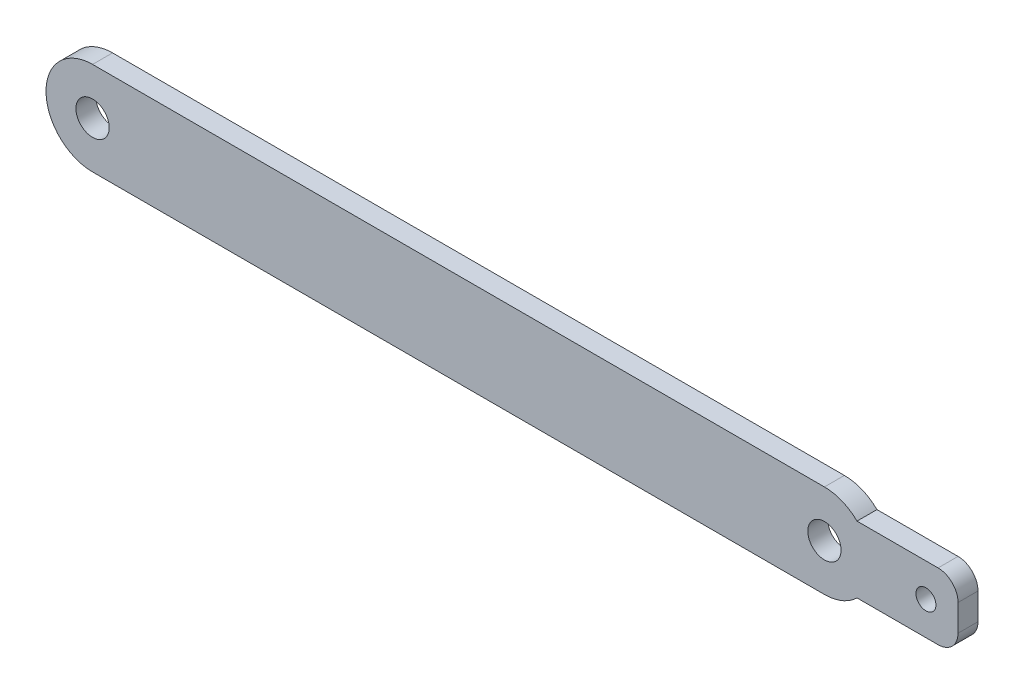
ISO-10303-21;
HEADER;
FILE_DESCRIPTION(('STEP AP214'),'2;1');
FILE_NAME('part.step','',(''),(''),'','','');
FILE_SCHEMA(('AUTOMOTIVE_DESIGN { 1 0 10303 214 1 1 1 1 }'));
ENDSEC;
DATA;
#1=APPLICATION_CONTEXT('core data for automotive mechanical design processes');
#2=APPLICATION_PROTOCOL_DEFINITION('international standard','automotive_design',2000,#1);
#3=PRODUCT_CONTEXT('',#1,'mechanical');
#4=PRODUCT('Part','Part','',(#3));
#5=PRODUCT_RELATED_PRODUCT_CATEGORY('part','',(#4));
#6=PRODUCT_DEFINITION_FORMATION('','',#4);
#7=PRODUCT_DEFINITION_CONTEXT('part definition',#1,'design');
#8=PRODUCT_DEFINITION('design','',#6,#7);
#9=PRODUCT_DEFINITION_SHAPE('','',#8);
#10=(LENGTH_UNIT() NAMED_UNIT(*) SI_UNIT(.MILLI.,.METRE.));
#11=(NAMED_UNIT(*) PLANE_ANGLE_UNIT() SI_UNIT($,.RADIAN.));
#12=(NAMED_UNIT(*) SI_UNIT($,.STERADIAN.) SOLID_ANGLE_UNIT());
#13=UNCERTAINTY_MEASURE_WITH_UNIT(LENGTH_MEASURE(1.E-05),#10,'distance_accuracy_value','');
#14=(GEOMETRIC_REPRESENTATION_CONTEXT(3) GLOBAL_UNCERTAINTY_ASSIGNED_CONTEXT((#13)) GLOBAL_UNIT_ASSIGNED_CONTEXT((#10,
#11,#12)) REPRESENTATION_CONTEXT('',''));
#15=CARTESIAN_POINT('',(0.,0.,0.));
#16=DIRECTION('',(0.,0.,1.));
#17=DIRECTION('',(1.,0.,0.));
#18=AXIS2_PLACEMENT_3D('',#15,#16,#17);
#19=CARTESIAN_POINT('',(39.0409907008859,262.154117688394,3.));
#20=DIRECTION('',(0.,0.,-1.));
#21=DIRECTION('',(-1.,0.,0.));
#22=AXIS2_PLACEMENT_3D('',#19,#20,#21);
#23=CYLINDRICAL_SURFACE('',#22,7.00000000000001);
#24=CARTESIAN_POINT('',(39.0409907008859,262.154117688394,0.));
#25=DIRECTION('',(0.,0.,1.));
#26=DIRECTION('',(1.,0.,0.));
#27=AXIS2_PLACEMENT_3D('',#24,#25,#26);
#28=CIRCLE('',#27,7.00000000000001);
#29=CARTESIAN_POINT('',(39.0409907008859,255.154117688394,0.));
#30=VERTEX_POINT('',#29);
#31=CARTESIAN_POINT('',(43.9399701864523,257.154117688394,0.));
#32=VERTEX_POINT('',#31);
#33=EDGE_CURVE('E184',#30,#32,#28,.T.);
#34=ORIENTED_EDGE('',*,*,#33,.T.);
#35=DIRECTION('',(0.,0.,-1.));
#36=VECTOR('',#35,1.);
#37=CARTESIAN_POINT('',(43.9399701864523,257.154117688394,3.));
#38=LINE('',#37,#36);
#39=CARTESIAN_POINT('',(43.9399701864523,257.154117688394,3.));
#40=VERTEX_POINT('',#39);
#41=EDGE_CURVE('E11',#32,#40,#38,.F.);
#42=ORIENTED_EDGE('',*,*,#41,.T.);
#43=CARTESIAN_POINT('',(39.0409907008859,262.154117688394,3.));
#44=DIRECTION('',(0.,0.,1.));
#45=DIRECTION('',(1.,0.,0.));
#46=AXIS2_PLACEMENT_3D('',#43,#44,#45);
#47=CIRCLE('',#46,7.00000000000001);
#48=CARTESIAN_POINT('',(39.0409907008859,255.154117688394,3.));
#49=VERTEX_POINT('',#48);
#50=EDGE_CURVE('E119',#49,#40,#47,.T.);
#51=ORIENTED_EDGE('',*,*,#50,.F.);
#52=DIRECTION('',(0.,0.,-1.));
#53=VECTOR('',#52,1.);
#54=CARTESIAN_POINT('',(39.0409907008859,255.154117688394,3.));
#55=LINE('',#54,#53);
#56=EDGE_CURVE('E192',#49,#30,#55,.T.);
#57=ORIENTED_EDGE('',*,*,#56,.T.);
#58=EDGE_LOOP('',(#34,#42,#51,#57));
#59=FACE_BOUND('',#58,.T.);
#60=ADVANCED_FACE('F35',(#59),#23,.T.);
#61=CARTESIAN_POINT('',(-70.9590092991141,262.154117688394,3.));
#62=DIRECTION('',(0.,0.,1.));
#63=DIRECTION('',(1.,0.,0.));
#64=AXIS2_PLACEMENT_3D('',#61,#62,#63);
#65=PLANE('',#64);
#66=ORIENTED_EDGE('',*,*,#50,.T.);
#67=DIRECTION('',(1.,0.,0.));
#68=VECTOR('',#67,1.);
#69=CARTESIAN_POINT('',(56.1253587637813,257.154117688394,3.));
#70=LINE('',#69,#68);
#71=CARTESIAN_POINT('',(56.1253587637813,257.154117688394,3.));
#72=VERTEX_POINT('',#71);
#73=EDGE_CURVE('E112',#40,#72,#70,.T.);
#74=ORIENTED_EDGE('',*,*,#73,.T.);
#75=CARTESIAN_POINT('',(56.1253587637813,260.154117688394,3.));
#76=DIRECTION('',(0.,0.,1.));
#77=DIRECTION('',(-1.,0.,0.));
#78=AXIS2_PLACEMENT_3D('',#75,#76,#77);
#79=CIRCLE('',#78,3.);
#80=CARTESIAN_POINT('',(59.1253587637813,260.154117688394,3.));
#81=VERTEX_POINT('',#80);
#82=EDGE_CURVE('E118',#72,#81,#79,.T.);
#83=ORIENTED_EDGE('',*,*,#82,.T.);
#84=DIRECTION('',(0.,1.,0.));
#85=VECTOR('',#84,1.);
#86=CARTESIAN_POINT('',(59.1253587637813,264.154117688394,3.));
#87=LINE('',#86,#85);
#88=CARTESIAN_POINT('',(59.1253587637813,264.154117688394,3.));
#89=VERTEX_POINT('',#88);
#90=EDGE_CURVE('E137',#81,#89,#87,.T.);
#91=ORIENTED_EDGE('',*,*,#90,.T.);
#92=CARTESIAN_POINT('',(56.1253587637813,264.154117688394,3.));
#93=DIRECTION('',(0.,0.,1.));
#94=DIRECTION('',(-1.,0.,0.));
#95=AXIS2_PLACEMENT_3D('',#92,#93,#94);
#96=CIRCLE('',#95,3.);
#97=CARTESIAN_POINT('',(56.1253587637813,267.154117688394,3.));
#98=VERTEX_POINT('',#97);
#99=EDGE_CURVE('E139',#89,#98,#96,.T.);
#100=ORIENTED_EDGE('',*,*,#99,.T.);
#101=DIRECTION('',(-1.,0.,0.));
#102=VECTOR('',#101,1.);
#103=CARTESIAN_POINT('',(56.1253587637813,267.154117688394,3.));
#104=LINE('',#103,#102);
#105=CARTESIAN_POINT('',(43.9399701864523,267.154117688394,3.));
#106=VERTEX_POINT('',#105);
#107=EDGE_CURVE('E132',#98,#106,#104,.T.);
#108=ORIENTED_EDGE('',*,*,#107,.T.);
#109=CARTESIAN_POINT('',(39.0409907008859,269.154117688394,3.));
#110=VERTEX_POINT('',#109);
#111=EDGE_CURVE('E50',#106,#110,#47,.T.);
#112=ORIENTED_EDGE('',*,*,#111,.T.);
#113=DIRECTION('',(-1.,0.,0.));
#114=VECTOR('',#113,1.);
#115=CARTESIAN_POINT('',(-70.9590092991141,269.154117688394,3.));
#116=LINE('',#115,#114);
#117=CARTESIAN_POINT('',(-70.9590092991141,269.154117688394,3.));
#118=VERTEX_POINT('',#117);
#119=EDGE_CURVE('E176',#110,#118,#116,.T.);
#120=ORIENTED_EDGE('',*,*,#119,.T.);
#121=CARTESIAN_POINT('',(-70.9590092991141,262.154117688394,3.));
#122=DIRECTION('',(0.,0.,1.));
#123=DIRECTION('',(1.,0.,0.));
#124=AXIS2_PLACEMENT_3D('',#121,#122,#123);
#125=CIRCLE('',#124,7.00000000000001);
#126=CARTESIAN_POINT('',(-70.9590092991141,255.154117688394,3.));
#127=VERTEX_POINT('',#126);
#128=EDGE_CURVE('E169',#118,#127,#125,.T.);
#129=ORIENTED_EDGE('',*,*,#128,.T.);
#130=DIRECTION('',(1.,0.,0.));
#131=VECTOR('',#130,1.);
#132=CARTESIAN_POINT('',(39.0409907008859,255.154117688394,3.));
#133=LINE('',#132,#131);
#134=EDGE_CURVE('E172',#127,#49,#133,.T.);
#135=ORIENTED_EDGE('',*,*,#134,.T.);
#136=EDGE_LOOP('',(#66,#74,#83,#91,#100,#108,#112,#120,#129,#135));
#137=FACE_BOUND('',#136,.T.);
#138=CARTESIAN_POINT('',(-70.9590092991141,262.154117688394,3.));
#139=DIRECTION('',(0.,0.,1.));
#140=DIRECTION('',(1.,0.,0.));
#141=AXIS2_PLACEMENT_3D('',#138,#139,#140);
#142=CIRCLE('',#141,2.5);
#143=CARTESIAN_POINT('',(-68.4590092991141,262.154117688394,3.));
#144=VERTEX_POINT('',#143);
#145=EDGE_CURVE('E163',#144,#144,#142,.T.);
#146=ORIENTED_EDGE('',*,*,#145,.F.);
#147=EDGE_LOOP('',(#146));
#148=FACE_BOUND('',#147,.T.);
#149=CARTESIAN_POINT('',(39.0409907008859,262.154117688394,3.));
#150=DIRECTION('',(0.,0.,1.));
#151=DIRECTION('',(1.,0.,0.));
#152=AXIS2_PLACEMENT_3D('',#149,#150,#151);
#153=CIRCLE('',#152,2.5);
#154=CARTESIAN_POINT('',(41.5409907008859,262.154117688394,3.));
#155=VERTEX_POINT('',#154);
#156=EDGE_CURVE('E157',#155,#155,#153,.T.);
#157=ORIENTED_EDGE('',*,*,#156,.F.);
#158=EDGE_LOOP('',(#157));
#159=FACE_BOUND('',#158,.T.);
#160=CARTESIAN_POINT('',(54.3036812436672,262.154117688394,3.));
#161=DIRECTION('',(0.,0.,1.));
#162=DIRECTION('',(1.,0.,0.));
#163=AXIS2_PLACEMENT_3D('',#160,#161,#162);
#164=CIRCLE('',#163,1.5);
#165=CARTESIAN_POINT('',(55.8036812436672,262.154117688394,3.));
#166=VERTEX_POINT('',#165);
#167=EDGE_CURVE('E121',#166,#166,#164,.T.);
#168=ORIENTED_EDGE('',*,*,#167,.F.);
#169=EDGE_LOOP('',(#168));
#170=FACE_BOUND('',#169,.T.);
#171=ADVANCED_FACE('F114',(#137,#148,#159,#170),#65,.T.);
#172=CARTESIAN_POINT('',(-70.9590092991141,262.154117688394,0.));
#173=DIRECTION('',(0.,0.,1.));
#174=DIRECTION('',(1.,0.,0.));
#175=AXIS2_PLACEMENT_3D('',#172,#173,#174);
#176=PLANE('',#175);
#177=DIRECTION('',(-1.,0.,0.));
#178=VECTOR('',#177,1.);
#179=CARTESIAN_POINT('',(56.1253587637813,257.154117688394,0.));
#180=LINE('',#179,#178);
#181=CARTESIAN_POINT('',(56.1253587637813,257.154117688394,0.));
#182=VERTEX_POINT('',#181);
#183=EDGE_CURVE('E128',#182,#32,#180,.T.);
#184=ORIENTED_EDGE('',*,*,#183,.T.);
#185=ORIENTED_EDGE('',*,*,#33,.F.);
#186=DIRECTION('',(1.,0.,0.));
#187=VECTOR('',#186,1.);
#188=CARTESIAN_POINT('',(39.0409907008859,255.154117688394,0.));
#189=LINE('',#188,#187);
#190=CARTESIAN_POINT('',(-70.9590092991141,255.154117688394,0.));
#191=VERTEX_POINT('',#190);
#192=EDGE_CURVE('E181',#191,#30,#189,.T.);
#193=ORIENTED_EDGE('',*,*,#192,.F.);
#194=CARTESIAN_POINT('',(-70.9590092991141,262.154117688394,0.));
#195=DIRECTION('',(0.,0.,1.));
#196=DIRECTION('',(1.,0.,0.));
#197=AXIS2_PLACEMENT_3D('',#194,#195,#196);
#198=CIRCLE('',#197,7.00000000000001);
#199=CARTESIAN_POINT('',(-70.9590092991141,269.154117688394,0.));
#200=VERTEX_POINT('',#199);
#201=EDGE_CURVE('E166',#200,#191,#198,.T.);
#202=ORIENTED_EDGE('',*,*,#201,.F.);
#203=DIRECTION('',(-1.,0.,0.));
#204=VECTOR('',#203,1.);
#205=CARTESIAN_POINT('',(-70.9590092991141,269.154117688394,0.));
#206=LINE('',#205,#204);
#207=CARTESIAN_POINT('',(39.0409907008859,269.154117688394,0.));
#208=VERTEX_POINT('',#207);
#209=EDGE_CURVE('E173',#208,#200,#206,.T.);
#210=ORIENTED_EDGE('',*,*,#209,.F.);
#211=CARTESIAN_POINT('',(43.9399701864523,267.154117688394,0.));
#212=VERTEX_POINT('',#211);
#213=EDGE_CURVE('E183',#212,#208,#28,.T.);
#214=ORIENTED_EDGE('',*,*,#213,.F.);
#215=DIRECTION('',(1.,0.,0.));
#216=VECTOR('',#215,1.);
#217=CARTESIAN_POINT('',(56.1253587637813,267.154117688394,0.));
#218=LINE('',#217,#216);
#219=CARTESIAN_POINT('',(56.1253587637813,267.154117688394,0.));
#220=VERTEX_POINT('',#219);
#221=EDGE_CURVE('E202',#212,#220,#218,.T.);
#222=ORIENTED_EDGE('',*,*,#221,.T.);
#223=CARTESIAN_POINT('',(56.1253587637813,264.154117688394,0.));
#224=DIRECTION('',(0.,0.,1.));
#225=DIRECTION('',(1.,0.,0.));
#226=AXIS2_PLACEMENT_3D('',#223,#224,#225);
#227=CIRCLE('',#226,3.);
#228=CARTESIAN_POINT('',(59.1253587637813,264.154117688394,0.));
#229=VERTEX_POINT('',#228);
#230=EDGE_CURVE('E206',#220,#229,#227,.F.);
#231=ORIENTED_EDGE('',*,*,#230,.T.);
#232=DIRECTION('',(0.,-1.,0.));
#233=VECTOR('',#232,1.);
#234=CARTESIAN_POINT('',(59.1253587637813,264.154117688394,0.));
#235=LINE('',#234,#233);
#236=CARTESIAN_POINT('',(59.1253587637813,260.154117688394,0.));
#237=VERTEX_POINT('',#236);
#238=EDGE_CURVE('E209',#229,#237,#235,.T.);
#239=ORIENTED_EDGE('',*,*,#238,.T.);
#240=CARTESIAN_POINT('',(56.1253587637813,260.154117688394,0.));
#241=DIRECTION('',(0.,0.,1.));
#242=DIRECTION('',(1.,0.,0.));
#243=AXIS2_PLACEMENT_3D('',#240,#241,#242);
#244=CIRCLE('',#243,3.);
#245=EDGE_CURVE('E149',#237,#182,#244,.F.);
#246=ORIENTED_EDGE('',*,*,#245,.T.);
#247=EDGE_LOOP('',(#184,#185,#193,#202,#210,#214,#222,#231,#239,#246));
#248=FACE_BOUND('',#247,.T.);
#249=CARTESIAN_POINT('',(-70.9590092991141,262.154117688394,0.));
#250=DIRECTION('',(0.,0.,1.));
#251=DIRECTION('',(1.,0.,0.));
#252=AXIS2_PLACEMENT_3D('',#249,#250,#251);
#253=CIRCLE('',#252,2.5);
#254=CARTESIAN_POINT('',(-68.4590092991141,262.154117688394,0.));
#255=VERTEX_POINT('',#254);
#256=EDGE_CURVE('E160',#255,#255,#253,.T.);
#257=ORIENTED_EDGE('',*,*,#256,.T.);
#258=EDGE_LOOP('',(#257));
#259=FACE_BOUND('',#258,.T.);
#260=CARTESIAN_POINT('',(39.0409907008859,262.154117688394,0.));
#261=DIRECTION('',(0.,0.,1.));
#262=DIRECTION('',(1.,0.,0.));
#263=AXIS2_PLACEMENT_3D('',#260,#261,#262);
#264=CIRCLE('',#263,2.5);
#265=CARTESIAN_POINT('',(41.5409907008859,262.154117688394,0.));
#266=VERTEX_POINT('',#265);
#267=EDGE_CURVE('E156',#266,#266,#264,.T.);
#268=ORIENTED_EDGE('',*,*,#267,.T.);
#269=EDGE_LOOP('',(#268));
#270=FACE_BOUND('',#269,.T.);
#271=CARTESIAN_POINT('',(54.3036812436672,262.154117688394,0.));
#272=DIRECTION('',(0.,0.,1.));
#273=DIRECTION('',(1.,0.,0.));
#274=AXIS2_PLACEMENT_3D('',#271,#272,#273);
#275=CIRCLE('',#274,1.5);
#276=CARTESIAN_POINT('',(55.8036812436672,262.154117688394,0.));
#277=VERTEX_POINT('',#276);
#278=EDGE_CURVE('E153',#277,#277,#275,.F.);
#279=ORIENTED_EDGE('',*,*,#278,.F.);
#280=EDGE_LOOP('',(#279));
#281=FACE_BOUND('',#280,.T.);
#282=ADVANCED_FACE('F218',(#248,#259,#270,#281),#176,.F.);
#283=CARTESIAN_POINT('',(-70.9590092991141,262.154117688394,3.));
#284=DIRECTION('',(0.,0.,-1.));
#285=DIRECTION('',(-1.,0.,0.));
#286=AXIS2_PLACEMENT_3D('',#283,#284,#285);
#287=CYLINDRICAL_SURFACE('',#286,7.00000000000001);
#288=ORIENTED_EDGE('',*,*,#201,.T.);
#289=DIRECTION('',(0.,0.,-1.));
#290=VECTOR('',#289,1.);
#291=CARTESIAN_POINT('',(-70.9590092991141,255.154117688394,3.));
#292=LINE('',#291,#290);
#293=EDGE_CURVE('E195',#127,#191,#292,.T.);
#294=ORIENTED_EDGE('',*,*,#293,.F.);
#295=ORIENTED_EDGE('',*,*,#128,.F.);
#296=DIRECTION('',(0.,0.,-1.));
#297=VECTOR('',#296,1.);
#298=CARTESIAN_POINT('',(-70.9590092991141,269.154117688394,3.));
#299=LINE('',#298,#297);
#300=EDGE_CURVE('E178',#118,#200,#299,.T.);
#301=ORIENTED_EDGE('',*,*,#300,.T.);
#302=EDGE_LOOP('',(#288,#294,#295,#301));
#303=FACE_BOUND('',#302,.T.);
#304=ADVANCED_FACE('F37',(#303),#287,.T.);
#305=CARTESIAN_POINT('',(39.0409907008859,255.154117688394,3.));
#306=DIRECTION('',(0.,1.,0.));
#307=DIRECTION('',(0.,0.,1.));
#308=AXIS2_PLACEMENT_3D('',#305,#306,#307);
#309=PLANE('',#308);
#310=ORIENTED_EDGE('',*,*,#192,.T.);
#311=ORIENTED_EDGE('',*,*,#56,.F.);
#312=ORIENTED_EDGE('',*,*,#134,.F.);
#313=ORIENTED_EDGE('',*,*,#293,.T.);
#314=EDGE_LOOP('',(#310,#311,#312,#313));
#315=FACE_BOUND('',#314,.T.);
#316=ADVANCED_FACE('F234',(#315),#309,.F.);
#317=ORIENTED_EDGE('',*,*,#111,.F.);
#318=DIRECTION('',(0.,0.,-1.));
#319=VECTOR('',#318,1.);
#320=CARTESIAN_POINT('',(43.9399701864523,267.154117688394,3.));
#321=LINE('',#320,#319);
#322=EDGE_CURVE('E43',#106,#212,#321,.T.);
#323=ORIENTED_EDGE('',*,*,#322,.T.);
#324=ORIENTED_EDGE('',*,*,#213,.T.);
#325=DIRECTION('',(0.,0.,-1.));
#326=VECTOR('',#325,1.);
#327=CARTESIAN_POINT('',(39.0409907008859,269.154117688394,3.));
#328=LINE('',#327,#326);
#329=EDGE_CURVE('E189',#110,#208,#328,.T.);
#330=ORIENTED_EDGE('',*,*,#329,.F.);
#331=EDGE_LOOP('',(#317,#323,#324,#330));
#332=FACE_BOUND('',#331,.T.);
#333=ADVANCED_FACE('F198',(#332),#23,.T.);
#334=CARTESIAN_POINT('',(-70.9590092991141,269.154117688394,3.));
#335=DIRECTION('',(0.,-1.,0.));
#336=DIRECTION('',(0.,0.,-1.));
#337=AXIS2_PLACEMENT_3D('',#334,#335,#336);
#338=PLANE('',#337);
#339=ORIENTED_EDGE('',*,*,#209,.T.);
#340=ORIENTED_EDGE('',*,*,#300,.F.);
#341=ORIENTED_EDGE('',*,*,#119,.F.);
#342=ORIENTED_EDGE('',*,*,#329,.T.);
#343=EDGE_LOOP('',(#339,#340,#341,#342));
#344=FACE_BOUND('',#343,.T.);
#345=ADVANCED_FACE('F230',(#344),#338,.F.);
#346=CARTESIAN_POINT('',(-70.9590092991141,262.154117688394,3.));
#347=DIRECTION('',(0.,0.,-1.));
#348=DIRECTION('',(-1.,0.,0.));
#349=AXIS2_PLACEMENT_3D('',#346,#347,#348);
#350=CYLINDRICAL_SURFACE('',#349,2.5);
#351=ORIENTED_EDGE('',*,*,#145,.T.);
#352=EDGE_LOOP('',(#351));
#353=FACE_BOUND('',#352,.T.);
#354=ORIENTED_EDGE('',*,*,#256,.F.);
#355=EDGE_LOOP('',(#354));
#356=FACE_BOUND('',#355,.T.);
#357=ADVANCED_FACE('F227',(#353,#356),#350,.F.);
#358=CARTESIAN_POINT('',(39.0409907008859,262.154117688394,3.));
#359=DIRECTION('',(0.,0.,-1.));
#360=DIRECTION('',(-1.,0.,0.));
#361=AXIS2_PLACEMENT_3D('',#358,#359,#360);
#362=CYLINDRICAL_SURFACE('',#361,2.5);
#363=ORIENTED_EDGE('',*,*,#156,.T.);
#364=EDGE_LOOP('',(#363));
#365=FACE_BOUND('',#364,.T.);
#366=ORIENTED_EDGE('',*,*,#267,.F.);
#367=EDGE_LOOP('',(#366));
#368=FACE_BOUND('',#367,.T.);
#369=ADVANCED_FACE('F268',(#365,#368),#362,.F.);
#370=CARTESIAN_POINT('',(56.1253587637813,257.154117688394,-19.3316448697864));
#371=DIRECTION('',(0.,-1.,0.));
#372=DIRECTION('',(0.,0.,-1.));
#373=AXIS2_PLACEMENT_3D('',#370,#371,#372);
#374=PLANE('',#373);
#375=ORIENTED_EDGE('',*,*,#41,.F.);
#376=ORIENTED_EDGE('',*,*,#183,.F.);
#377=DIRECTION('',(0.,0.,1.));
#378=VECTOR('',#377,1.);
#379=CARTESIAN_POINT('',(56.1253587637813,257.154117688394,-19.3316448697864));
#380=LINE('',#379,#378);
#381=EDGE_CURVE('E125',#182,#72,#380,.T.);
#382=ORIENTED_EDGE('',*,*,#381,.T.);
#383=ORIENTED_EDGE('',*,*,#73,.F.);
#384=EDGE_LOOP('',(#375,#376,#382,#383));
#385=FACE_BOUND('',#384,.T.);
#386=ADVANCED_FACE('F126',(#385),#374,.T.);
#387=CARTESIAN_POINT('',(56.1253587637813,267.154117688394,-19.3316448697864));
#388=DIRECTION('',(0.,1.,0.));
#389=DIRECTION('',(0.,0.,1.));
#390=AXIS2_PLACEMENT_3D('',#387,#388,#389);
#391=PLANE('',#390);
#392=ORIENTED_EDGE('',*,*,#322,.F.);
#393=ORIENTED_EDGE('',*,*,#107,.F.);
#394=DIRECTION('',(0.,0.,1.));
#395=VECTOR('',#394,1.);
#396=CARTESIAN_POINT('',(56.1253587637813,267.154117688394,-19.3316448697864));
#397=LINE('',#396,#395);
#398=EDGE_CURVE('E147',#220,#98,#397,.T.);
#399=ORIENTED_EDGE('',*,*,#398,.F.);
#400=ORIENTED_EDGE('',*,*,#221,.F.);
#401=EDGE_LOOP('',(#392,#393,#399,#400));
#402=FACE_BOUND('',#401,.T.);
#403=ADVANCED_FACE('F203',(#402),#391,.T.);
#404=CARTESIAN_POINT('',(56.1253587637813,260.154117688394,-19.3316448697864));
#405=DIRECTION('',(0.,0.,1.));
#406=DIRECTION('',(1.,0.,0.));
#407=AXIS2_PLACEMENT_3D('',#404,#405,#406);
#408=CYLINDRICAL_SURFACE('',#407,3.);
#409=ORIENTED_EDGE('',*,*,#245,.F.);
#410=DIRECTION('',(0.,0.,1.));
#411=VECTOR('',#410,1.);
#412=CARTESIAN_POINT('',(59.1253587637813,260.154117688394,-19.3316448697864));
#413=LINE('',#412,#411);
#414=EDGE_CURVE('E131',#237,#81,#413,.T.);
#415=ORIENTED_EDGE('',*,*,#414,.T.);
#416=ORIENTED_EDGE('',*,*,#82,.F.);
#417=ORIENTED_EDGE('',*,*,#381,.F.);
#418=EDGE_LOOP('',(#409,#415,#416,#417));
#419=FACE_BOUND('',#418,.T.);
#420=ADVANCED_FACE('F134',(#419),#408,.T.);
#421=CARTESIAN_POINT('',(59.1253587637813,264.154117688394,-19.3316448697864));
#422=DIRECTION('',(1.,0.,0.));
#423=DIRECTION('',(0.,0.,-1.));
#424=AXIS2_PLACEMENT_3D('',#421,#422,#423);
#425=PLANE('',#424);
#426=ORIENTED_EDGE('',*,*,#238,.F.);
#427=DIRECTION('',(0.,0.,1.));
#428=VECTOR('',#427,1.);
#429=CARTESIAN_POINT('',(59.1253587637813,264.154117688394,-19.3316448697864));
#430=LINE('',#429,#428);
#431=EDGE_CURVE('E150',#229,#89,#430,.T.);
#432=ORIENTED_EDGE('',*,*,#431,.T.);
#433=ORIENTED_EDGE('',*,*,#90,.F.);
#434=ORIENTED_EDGE('',*,*,#414,.F.);
#435=EDGE_LOOP('',(#426,#432,#433,#434));
#436=FACE_BOUND('',#435,.T.);
#437=ADVANCED_FACE('F249',(#436),#425,.T.);
#438=CARTESIAN_POINT('',(56.1253587637813,264.154117688394,-19.3316448697864));
#439=DIRECTION('',(0.,0.,1.));
#440=DIRECTION('',(1.,0.,0.));
#441=AXIS2_PLACEMENT_3D('',#438,#439,#440);
#442=CYLINDRICAL_SURFACE('',#441,3.);
#443=ORIENTED_EDGE('',*,*,#230,.F.);
#444=ORIENTED_EDGE('',*,*,#398,.T.);
#445=ORIENTED_EDGE('',*,*,#99,.F.);
#446=ORIENTED_EDGE('',*,*,#431,.F.);
#447=EDGE_LOOP('',(#443,#444,#445,#446));
#448=FACE_BOUND('',#447,.T.);
#449=ADVANCED_FACE('F253',(#448),#442,.T.);
#450=CARTESIAN_POINT('',(54.3036812436672,262.154117688394,-19.3316448697864));
#451=DIRECTION('',(0.,0.,1.));
#452=DIRECTION('',(1.,0.,0.));
#453=AXIS2_PLACEMENT_3D('',#450,#451,#452);
#454=CYLINDRICAL_SURFACE('',#453,1.5);
#455=ORIENTED_EDGE('',*,*,#278,.T.);
#456=EDGE_LOOP('',(#455));
#457=FACE_BOUND('',#456,.T.);
#458=ORIENTED_EDGE('',*,*,#167,.T.);
#459=EDGE_LOOP('',(#458));
#460=FACE_BOUND('',#459,.T.);
#461=ADVANCED_FACE('F215',(#457,#460),#454,.F.);
#462=CLOSED_SHELL('',(#60,#171,#282,#304,#316,#333,#345,#357,#369,#386,#403,#420,#437,#449,#461));
#463=MANIFOLD_SOLID_BREP('B2',#462);
#464=ADVANCED_BREP_SHAPE_REPRESENTATION('',(#18,#463),#14);
#465=SHAPE_DEFINITION_REPRESENTATION(#9,#464);
ENDSEC;
END-ISO-10303-21;
